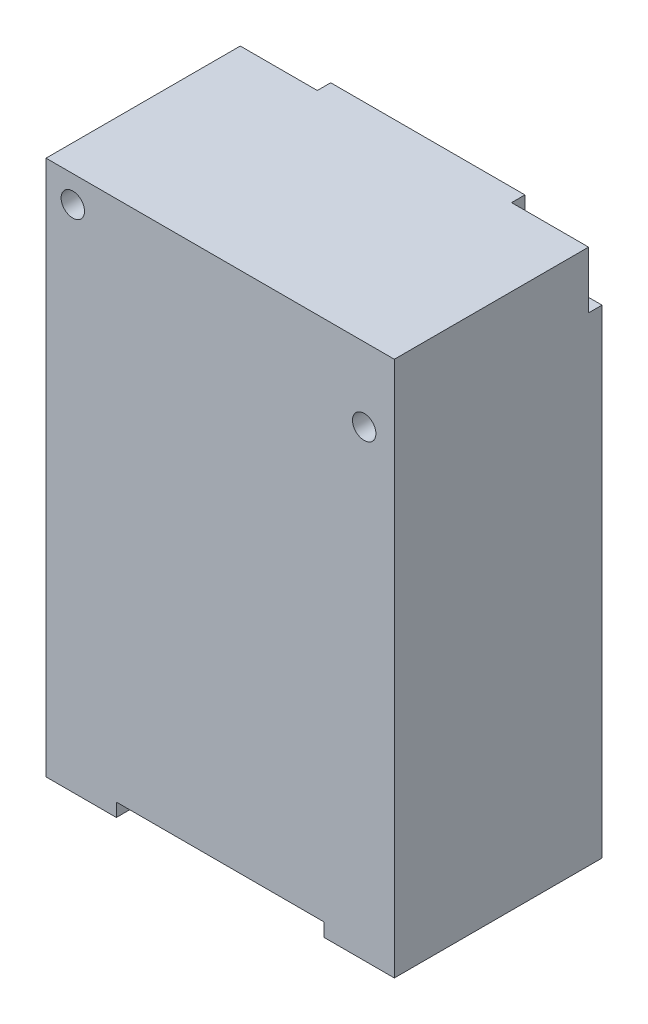
ISO-10303-21;
HEADER;
FILE_DESCRIPTION(('STEP AP214'),'2;1');
FILE_NAME('part.step','',(''),(''),'','','');
FILE_SCHEMA(('AUTOMOTIVE_DESIGN { 1 0 10303 214 1 1 1 1 }'));
ENDSEC;
DATA;
#1=APPLICATION_CONTEXT('core data for automotive mechanical design processes');
#2=APPLICATION_PROTOCOL_DEFINITION('international standard','automotive_design',2000,#1);
#3=PRODUCT_CONTEXT('',#1,'mechanical');
#4=PRODUCT('Part','Part','',(#3));
#5=PRODUCT_RELATED_PRODUCT_CATEGORY('part','',(#4));
#6=PRODUCT_DEFINITION_FORMATION('','',#4);
#7=PRODUCT_DEFINITION_CONTEXT('part definition',#1,'design');
#8=PRODUCT_DEFINITION('design','',#6,#7);
#9=PRODUCT_DEFINITION_SHAPE('','',#8);
#10=(LENGTH_UNIT() NAMED_UNIT(*) SI_UNIT(.MILLI.,.METRE.));
#11=(NAMED_UNIT(*) PLANE_ANGLE_UNIT() SI_UNIT($,.RADIAN.));
#12=(NAMED_UNIT(*) SI_UNIT($,.STERADIAN.) SOLID_ANGLE_UNIT());
#13=UNCERTAINTY_MEASURE_WITH_UNIT(LENGTH_MEASURE(1.E-05),#10,'distance_accuracy_value','');
#14=(GEOMETRIC_REPRESENTATION_CONTEXT(3) GLOBAL_UNCERTAINTY_ASSIGNED_CONTEXT((#13)) GLOBAL_UNIT_ASSIGNED_CONTEXT((#10,
#11,#12)) REPRESENTATION_CONTEXT('',''));
#15=CARTESIAN_POINT('',(0.,0.,0.));
#16=DIRECTION('',(0.,0.,1.));
#17=DIRECTION('',(1.,0.,0.));
#18=AXIS2_PLACEMENT_3D('',#15,#16,#17);
#19=CARTESIAN_POINT('',(0.,0.,31.));
#20=DIRECTION('',(0.,0.,1.));
#21=DIRECTION('',(1.,0.,0.));
#22=AXIS2_PLACEMENT_3D('',#19,#20,#21);
#23=PLANE('',#22);
#24=DIRECTION('',(0.,-1.,0.));
#25=VECTOR('',#24,1.);
#26=CARTESIAN_POINT('',(-15.5,-38.,31.));
#27=LINE('',#26,#25);
#28=CARTESIAN_POINT('',(-15.5,-38.,31.));
#29=VERTEX_POINT('',#28);
#30=CARTESIAN_POINT('',(-15.5,-40.,31.));
#31=VERTEX_POINT('',#30);
#32=EDGE_CURVE('E209',#29,#31,#27,.T.);
#33=ORIENTED_EDGE('',*,*,#32,.F.);
#34=DIRECTION('',(-1.,0.,0.));
#35=VECTOR('',#34,1.);
#36=CARTESIAN_POINT('',(15.5,-38.,31.));
#37=LINE('',#36,#35);
#38=CARTESIAN_POINT('',(15.5,-38.,31.));
#39=VERTEX_POINT('',#38);
#40=EDGE_CURVE('E199',#39,#29,#37,.T.);
#41=ORIENTED_EDGE('',*,*,#40,.F.);
#42=DIRECTION('',(0.,-1.,0.));
#43=VECTOR('',#42,1.);
#44=CARTESIAN_POINT('',(15.5,-38.,31.));
#45=LINE('',#44,#43);
#46=CARTESIAN_POINT('',(15.5,-40.,31.));
#47=VERTEX_POINT('',#46);
#48=EDGE_CURVE('E212',#39,#47,#45,.T.);
#49=ORIENTED_EDGE('',*,*,#48,.T.);
#50=DIRECTION('',(1.,0.,0.));
#51=VECTOR('',#50,1.);
#52=CARTESIAN_POINT('',(26.,-40.,31.));
#53=LINE('',#52,#51);
#54=CARTESIAN_POINT('',(26.,-40.,31.));
#55=VERTEX_POINT('',#54);
#56=EDGE_CURVE('E228',#47,#55,#53,.T.);
#57=ORIENTED_EDGE('',*,*,#56,.T.);
#58=DIRECTION('',(0.,1.,0.));
#59=VECTOR('',#58,1.);
#60=CARTESIAN_POINT('',(26.,-40.,31.));
#61=LINE('',#60,#59);
#62=CARTESIAN_POINT('',(26.,40.,31.));
#63=VERTEX_POINT('',#62);
#64=EDGE_CURVE('E233',#55,#63,#61,.T.);
#65=ORIENTED_EDGE('',*,*,#64,.T.);
#66=DIRECTION('',(-1.,0.,0.));
#67=VECTOR('',#66,1.);
#68=CARTESIAN_POINT('',(26.,40.,31.));
#69=LINE('',#68,#67);
#70=CARTESIAN_POINT('',(-26.,40.,31.));
#71=VERTEX_POINT('',#70);
#72=EDGE_CURVE('E235',#63,#71,#69,.T.);
#73=ORIENTED_EDGE('',*,*,#72,.T.);
#74=DIRECTION('',(0.,-1.,0.));
#75=VECTOR('',#74,1.);
#76=CARTESIAN_POINT('',(-26.,-40.,31.));
#77=LINE('',#76,#75);
#78=CARTESIAN_POINT('',(-26.,-40.,31.));
#79=VERTEX_POINT('',#78);
#80=EDGE_CURVE('E225',#71,#79,#77,.T.);
#81=ORIENTED_EDGE('',*,*,#80,.T.);
#82=EDGE_CURVE('E230',#79,#31,#53,.T.);
#83=ORIENTED_EDGE('',*,*,#82,.T.);
#84=EDGE_LOOP('',(#33,#41,#49,#57,#65,#73,#81,#83));
#85=FACE_BOUND('',#84,.T.);
#86=CARTESIAN_POINT('',(21.5,29.,31.));
#87=DIRECTION('',(0.,0.,1.));
#88=DIRECTION('',(1.,0.,0.));
#89=AXIS2_PLACEMENT_3D('',#86,#87,#88);
#90=CIRCLE('',#89,1.75);
#91=CARTESIAN_POINT('',(23.25,29.,31.));
#92=VERTEX_POINT('',#91);
#93=EDGE_CURVE('E221',#92,#92,#90,.T.);
#94=ORIENTED_EDGE('',*,*,#93,.F.);
#95=EDGE_LOOP('',(#94));
#96=FACE_BOUND('',#95,.T.);
#97=CARTESIAN_POINT('',(-22.,36.,31.));
#98=DIRECTION('',(0.,0.,1.));
#99=DIRECTION('',(1.,0.,0.));
#100=AXIS2_PLACEMENT_3D('',#97,#98,#99);
#101=CIRCLE('',#100,1.75);
#102=CARTESIAN_POINT('',(-20.25,36.,31.));
#103=VERTEX_POINT('',#102);
#104=EDGE_CURVE('E211',#103,#103,#101,.T.);
#105=ORIENTED_EDGE('',*,*,#104,.F.);
#106=EDGE_LOOP('',(#105));
#107=FACE_BOUND('',#106,.T.);
#108=ADVANCED_FACE('F36',(#85,#96,#107),#23,.T.);
#109=CARTESIAN_POINT('',(0.,0.,0.));
#110=DIRECTION('',(0.,0.,1.));
#111=DIRECTION('',(1.,0.,0.));
#112=AXIS2_PLACEMENT_3D('',#109,#110,#111);
#113=PLANE('',#112);
#114=DIRECTION('',(-1.,0.,0.));
#115=VECTOR('',#114,1.);
#116=CARTESIAN_POINT('',(26.,40.,0.));
#117=LINE('',#116,#115);
#118=CARTESIAN_POINT('',(14.5,40.,0.));
#119=VERTEX_POINT('',#118);
#120=CARTESIAN_POINT('',(-14.5,40.,0.));
#121=VERTEX_POINT('',#120);
#122=EDGE_CURVE('E229',#119,#121,#117,.T.);
#123=ORIENTED_EDGE('',*,*,#122,.F.);
#124=DIRECTION('',(0.,1.,0.));
#125=VECTOR('',#124,1.);
#126=CARTESIAN_POINT('',(14.5,40.,0.));
#127=LINE('',#126,#125);
#128=CARTESIAN_POINT('',(14.5,31.5,0.));
#129=VERTEX_POINT('',#128);
#130=EDGE_CURVE('E155',#129,#119,#127,.T.);
#131=ORIENTED_EDGE('',*,*,#130,.F.);
#132=DIRECTION('',(-1.,0.,0.));
#133=VECTOR('',#132,1.);
#134=CARTESIAN_POINT('',(26.,31.5,0.));
#135=LINE('',#134,#133);
#136=CARTESIAN_POINT('',(26.,31.5,0.));
#137=VERTEX_POINT('',#136);
#138=EDGE_CURVE('E181',#137,#129,#135,.T.);
#139=ORIENTED_EDGE('',*,*,#138,.F.);
#140=DIRECTION('',(0.,1.,0.));
#141=VECTOR('',#140,1.);
#142=CARTESIAN_POINT('',(26.,-40.,0.));
#143=LINE('',#142,#141);
#144=CARTESIAN_POINT('',(26.,-40.,0.));
#145=VERTEX_POINT('',#144);
#146=EDGE_CURVE('E161',#145,#137,#143,.T.);
#147=ORIENTED_EDGE('',*,*,#146,.F.);
#148=DIRECTION('',(1.,0.,0.));
#149=VECTOR('',#148,1.);
#150=CARTESIAN_POINT('',(26.,-40.,0.));
#151=LINE('',#150,#149);
#152=CARTESIAN_POINT('',(-26.,-40.,0.));
#153=VERTEX_POINT('',#152);
#154=EDGE_CURVE('E239',#153,#145,#151,.T.);
#155=ORIENTED_EDGE('',*,*,#154,.F.);
#156=DIRECTION('',(0.,-1.,0.));
#157=VECTOR('',#156,1.);
#158=CARTESIAN_POINT('',(-26.,-40.,0.));
#159=LINE('',#158,#157);
#160=CARTESIAN_POINT('',(-26.,31.5,0.));
#161=VERTEX_POINT('',#160);
#162=EDGE_CURVE('E224',#161,#153,#159,.T.);
#163=ORIENTED_EDGE('',*,*,#162,.F.);
#164=DIRECTION('',(-1.,0.,0.));
#165=VECTOR('',#164,1.);
#166=CARTESIAN_POINT('',(-26.,31.5,0.));
#167=LINE('',#166,#165);
#168=CARTESIAN_POINT('',(-14.5,31.5,0.));
#169=VERTEX_POINT('',#168);
#170=EDGE_CURVE('E175',#169,#161,#167,.T.);
#171=ORIENTED_EDGE('',*,*,#170,.F.);
#172=DIRECTION('',(0.,-1.,0.));
#173=VECTOR('',#172,1.);
#174=CARTESIAN_POINT('',(-14.5,40.,0.));
#175=LINE('',#174,#173);
#176=EDGE_CURVE('E177',#121,#169,#175,.T.);
#177=ORIENTED_EDGE('',*,*,#176,.F.);
#178=EDGE_LOOP('',(#123,#131,#139,#147,#155,#163,#171,#177));
#179=FACE_BOUND('',#178,.T.);
#180=ADVANCED_FACE('F267',(#179),#113,.F.);
#181=CARTESIAN_POINT('',(-26.,-40.,31.));
#182=DIRECTION('',(1.,0.,0.));
#183=DIRECTION('',(0.,1.,0.));
#184=AXIS2_PLACEMENT_3D('',#181,#182,#183);
#185=PLANE('',#184);
#186=DIRECTION('',(0.,1.,0.));
#187=VECTOR('',#186,1.);
#188=CARTESIAN_POINT('',(-26.,40.,2.));
#189=LINE('',#188,#187);
#190=CARTESIAN_POINT('',(-26.,31.5,2.));
#191=VERTEX_POINT('',#190);
#192=CARTESIAN_POINT('',(-26.,40.,2.));
#193=VERTEX_POINT('',#192);
#194=EDGE_CURVE('E59',#191,#193,#189,.T.);
#195=ORIENTED_EDGE('',*,*,#194,.F.);
#196=DIRECTION('',(0.,0.,-1.));
#197=VECTOR('',#196,1.);
#198=CARTESIAN_POINT('',(-26.,31.5,2.));
#199=LINE('',#198,#197);
#200=EDGE_CURVE('E172',#191,#161,#199,.T.);
#201=ORIENTED_EDGE('',*,*,#200,.T.);
#202=ORIENTED_EDGE('',*,*,#162,.T.);
#203=DIRECTION('',(0.,0.,-1.));
#204=VECTOR('',#203,1.);
#205=CARTESIAN_POINT('',(-26.,-40.,31.));
#206=LINE('',#205,#204);
#207=EDGE_CURVE('E250',#79,#153,#206,.T.);
#208=ORIENTED_EDGE('',*,*,#207,.F.);
#209=ORIENTED_EDGE('',*,*,#80,.F.);
#210=DIRECTION('',(0.,0.,-1.));
#211=VECTOR('',#210,1.);
#212=CARTESIAN_POINT('',(-26.,40.,31.));
#213=LINE('',#212,#211);
#214=EDGE_CURVE('E237',#71,#193,#213,.T.);
#215=ORIENTED_EDGE('',*,*,#214,.T.);
#216=EDGE_LOOP('',(#195,#201,#202,#208,#209,#215));
#217=FACE_BOUND('',#216,.T.);
#218=ADVANCED_FACE('F38',(#217),#185,.F.);
#219=CARTESIAN_POINT('',(26.,-40.,31.));
#220=DIRECTION('',(0.,1.,0.));
#221=DIRECTION('',(0.,0.,1.));
#222=AXIS2_PLACEMENT_3D('',#219,#220,#221);
#223=PLANE('',#222);
#224=DIRECTION('',(1.,0.,0.));
#225=VECTOR('',#224,1.);
#226=CARTESIAN_POINT('',(15.5,-40.,16.));
#227=LINE('',#226,#225);
#228=CARTESIAN_POINT('',(-15.5,-40.,16.));
#229=VERTEX_POINT('',#228);
#230=CARTESIAN_POINT('',(15.5,-40.,16.));
#231=VERTEX_POINT('',#230);
#232=EDGE_CURVE('E205',#229,#231,#227,.T.);
#233=ORIENTED_EDGE('',*,*,#232,.F.);
#234=DIRECTION('',(0.,0.,-1.));
#235=VECTOR('',#234,1.);
#236=CARTESIAN_POINT('',(-15.5,-40.,16.));
#237=LINE('',#236,#235);
#238=EDGE_CURVE('E203',#31,#229,#237,.T.);
#239=ORIENTED_EDGE('',*,*,#238,.F.);
#240=ORIENTED_EDGE('',*,*,#82,.F.);
#241=ORIENTED_EDGE('',*,*,#207,.T.);
#242=ORIENTED_EDGE('',*,*,#154,.T.);
#243=DIRECTION('',(0.,0.,-1.));
#244=VECTOR('',#243,1.);
#245=CARTESIAN_POINT('',(26.,-40.,31.));
#246=LINE('',#245,#244);
#247=EDGE_CURVE('E248',#55,#145,#246,.T.);
#248=ORIENTED_EDGE('',*,*,#247,.F.);
#249=ORIENTED_EDGE('',*,*,#56,.F.);
#250=DIRECTION('',(0.,0.,1.));
#251=VECTOR('',#250,1.);
#252=CARTESIAN_POINT('',(15.5,-40.,16.));
#253=LINE('',#252,#251);
#254=EDGE_CURVE('E193',#231,#47,#253,.T.);
#255=ORIENTED_EDGE('',*,*,#254,.F.);
#256=EDGE_LOOP('',(#233,#239,#240,#241,#242,#248,#249,#255));
#257=FACE_BOUND('',#256,.T.);
#258=ADVANCED_FACE('F292',(#257),#223,.F.);
#259=CARTESIAN_POINT('',(26.,-40.,31.));
#260=DIRECTION('',(-1.,0.,0.));
#261=DIRECTION('',(0.,0.,1.));
#262=AXIS2_PLACEMENT_3D('',#259,#260,#261);
#263=PLANE('',#262);
#264=ORIENTED_EDGE('',*,*,#146,.T.);
#265=DIRECTION('',(0.,0.,-1.));
#266=VECTOR('',#265,1.);
#267=CARTESIAN_POINT('',(26.,31.5,2.));
#268=LINE('',#267,#266);
#269=CARTESIAN_POINT('',(26.,31.5,2.));
#270=VERTEX_POINT('',#269);
#271=EDGE_CURVE('E143',#270,#137,#268,.T.);
#272=ORIENTED_EDGE('',*,*,#271,.F.);
#273=DIRECTION('',(0.,-1.,0.));
#274=VECTOR('',#273,1.);
#275=CARTESIAN_POINT('',(26.,40.,2.));
#276=LINE('',#275,#274);
#277=CARTESIAN_POINT('',(26.,40.,2.));
#278=VERTEX_POINT('',#277);
#279=EDGE_CURVE('E146',#278,#270,#276,.T.);
#280=ORIENTED_EDGE('',*,*,#279,.F.);
#281=DIRECTION('',(0.,0.,-1.));
#282=VECTOR('',#281,1.);
#283=CARTESIAN_POINT('',(26.,40.,31.));
#284=LINE('',#283,#282);
#285=EDGE_CURVE('E246',#63,#278,#284,.T.);
#286=ORIENTED_EDGE('',*,*,#285,.F.);
#287=ORIENTED_EDGE('',*,*,#64,.F.);
#288=ORIENTED_EDGE('',*,*,#247,.T.);
#289=EDGE_LOOP('',(#264,#272,#280,#286,#287,#288));
#290=FACE_BOUND('',#289,.T.);
#291=ADVANCED_FACE('F158',(#290),#263,.F.);
#292=CARTESIAN_POINT('',(26.,40.,31.));
#293=DIRECTION('',(0.,-1.,0.));
#294=DIRECTION('',(0.,0.,-1.));
#295=AXIS2_PLACEMENT_3D('',#292,#293,#294);
#296=PLANE('',#295);
#297=DIRECTION('',(1.,0.,0.));
#298=VECTOR('',#297,1.);
#299=CARTESIAN_POINT('',(26.,40.,2.));
#300=LINE('',#299,#298);
#301=CARTESIAN_POINT('',(14.5,40.,2.));
#302=VERTEX_POINT('',#301);
#303=EDGE_CURVE('E151',#302,#278,#300,.T.);
#304=ORIENTED_EDGE('',*,*,#303,.F.);
#305=DIRECTION('',(0.,0.,-1.));
#306=VECTOR('',#305,1.);
#307=CARTESIAN_POINT('',(14.5,40.,2.));
#308=LINE('',#307,#306);
#309=EDGE_CURVE('E163',#302,#119,#308,.T.);
#310=ORIENTED_EDGE('',*,*,#309,.T.);
#311=ORIENTED_EDGE('',*,*,#122,.T.);
#312=DIRECTION('',(0.,0.,-1.));
#313=VECTOR('',#312,1.);
#314=CARTESIAN_POINT('',(-14.5,40.,2.));
#315=LINE('',#314,#313);
#316=CARTESIAN_POINT('',(-14.5,40.,2.));
#317=VERTEX_POINT('',#316);
#318=EDGE_CURVE('E168',#317,#121,#315,.T.);
#319=ORIENTED_EDGE('',*,*,#318,.F.);
#320=DIRECTION('',(1.,0.,0.));
#321=VECTOR('',#320,1.);
#322=CARTESIAN_POINT('',(-26.,40.,2.));
#323=LINE('',#322,#321);
#324=EDGE_CURVE('E178',#193,#317,#323,.T.);
#325=ORIENTED_EDGE('',*,*,#324,.F.);
#326=ORIENTED_EDGE('',*,*,#214,.F.);
#327=ORIENTED_EDGE('',*,*,#72,.F.);
#328=ORIENTED_EDGE('',*,*,#285,.T.);
#329=EDGE_LOOP('',(#304,#310,#311,#319,#325,#326,#327,#328));
#330=FACE_BOUND('',#329,.T.);
#331=ADVANCED_FACE('F261',(#330),#296,.F.);
#332=CARTESIAN_POINT('',(21.5,29.,31.));
#333=DIRECTION('',(0.,0.,-1.));
#334=DIRECTION('',(-1.,0.,0.));
#335=AXIS2_PLACEMENT_3D('',#332,#333,#334);
#336=CYLINDRICAL_SURFACE('',#335,1.75);
#337=CARTESIAN_POINT('',(21.5,29.,25.));
#338=DIRECTION('',(0.,0.,1.));
#339=DIRECTION('',(1.,0.,0.));
#340=AXIS2_PLACEMENT_3D('',#337,#338,#339);
#341=CIRCLE('',#340,1.75);
#342=CARTESIAN_POINT('',(23.25,29.,25.));
#343=VERTEX_POINT('',#342);
#344=EDGE_CURVE('E44',#343,#343,#341,.T.);
#345=ORIENTED_EDGE('',*,*,#344,.F.);
#346=EDGE_LOOP('',(#345));
#347=FACE_BOUND('',#346,.T.);
#348=ORIENTED_EDGE('',*,*,#93,.T.);
#349=EDGE_LOOP('',(#348));
#350=FACE_BOUND('',#349,.T.);
#351=ADVANCED_FACE('F257',(#347,#350),#336,.F.);
#352=CARTESIAN_POINT('',(-22.,36.,31.));
#353=DIRECTION('',(0.,0.,-1.));
#354=DIRECTION('',(-1.,0.,0.));
#355=AXIS2_PLACEMENT_3D('',#352,#353,#354);
#356=CYLINDRICAL_SURFACE('',#355,1.75);
#357=CARTESIAN_POINT('',(-22.,36.,25.));
#358=DIRECTION('',(0.,0.,1.));
#359=DIRECTION('',(1.,0.,0.));
#360=AXIS2_PLACEMENT_3D('',#357,#358,#359);
#361=CIRCLE('',#360,1.75);
#362=CARTESIAN_POINT('',(-20.25,36.,25.));
#363=VERTEX_POINT('',#362);
#364=EDGE_CURVE('E11',#363,#363,#361,.T.);
#365=ORIENTED_EDGE('',*,*,#364,.F.);
#366=EDGE_LOOP('',(#365));
#367=FACE_BOUND('',#366,.T.);
#368=ORIENTED_EDGE('',*,*,#104,.T.);
#369=EDGE_LOOP('',(#368));
#370=FACE_BOUND('',#369,.T.);
#371=ADVANCED_FACE('F260',(#367,#370),#356,.F.);
#372=CARTESIAN_POINT('',(-15.5,-38.,16.));
#373=DIRECTION('',(-1.,0.,0.));
#374=DIRECTION('',(0.,0.,1.));
#375=AXIS2_PLACEMENT_3D('',#372,#373,#374);
#376=PLANE('',#375);
#377=ORIENTED_EDGE('',*,*,#238,.T.);
#378=DIRECTION('',(0.,-1.,0.));
#379=VECTOR('',#378,1.);
#380=CARTESIAN_POINT('',(-15.5,-38.,16.));
#381=LINE('',#380,#379);
#382=CARTESIAN_POINT('',(-15.5,-38.,16.));
#383=VERTEX_POINT('',#382);
#384=EDGE_CURVE('E202',#383,#229,#381,.T.);
#385=ORIENTED_EDGE('',*,*,#384,.F.);
#386=DIRECTION('',(0.,0.,-1.));
#387=VECTOR('',#386,1.);
#388=CARTESIAN_POINT('',(-15.5,-38.,16.));
#389=LINE('',#388,#387);
#390=EDGE_CURVE('E189',#29,#383,#389,.T.);
#391=ORIENTED_EDGE('',*,*,#390,.F.);
#392=ORIENTED_EDGE('',*,*,#32,.T.);
#393=EDGE_LOOP('',(#377,#385,#391,#392));
#394=FACE_BOUND('',#393,.T.);
#395=ADVANCED_FACE('F273',(#394),#376,.F.);
#396=CARTESIAN_POINT('',(15.5,-38.,16.));
#397=DIRECTION('',(1.,0.,0.));
#398=DIRECTION('',(0.,0.,-1.));
#399=AXIS2_PLACEMENT_3D('',#396,#397,#398);
#400=PLANE('',#399);
#401=ORIENTED_EDGE('',*,*,#254,.T.);
#402=ORIENTED_EDGE('',*,*,#48,.F.);
#403=DIRECTION('',(0.,0.,1.));
#404=VECTOR('',#403,1.);
#405=CARTESIAN_POINT('',(15.5,-38.,16.));
#406=LINE('',#405,#404);
#407=CARTESIAN_POINT('',(15.5,-38.,16.));
#408=VERTEX_POINT('',#407);
#409=EDGE_CURVE('E196',#408,#39,#406,.T.);
#410=ORIENTED_EDGE('',*,*,#409,.F.);
#411=DIRECTION('',(0.,-1.,0.));
#412=VECTOR('',#411,1.);
#413=CARTESIAN_POINT('',(15.5,-38.,16.));
#414=LINE('',#413,#412);
#415=EDGE_CURVE('E215',#408,#231,#414,.T.);
#416=ORIENTED_EDGE('',*,*,#415,.T.);
#417=EDGE_LOOP('',(#401,#402,#410,#416));
#418=FACE_BOUND('',#417,.T.);
#419=ADVANCED_FACE('F279',(#418),#400,.F.);
#420=CARTESIAN_POINT('',(15.5,-38.,16.));
#421=DIRECTION('',(0.,0.,-1.));
#422=DIRECTION('',(-1.,0.,0.));
#423=AXIS2_PLACEMENT_3D('',#420,#421,#422);
#424=PLANE('',#423);
#425=ORIENTED_EDGE('',*,*,#232,.T.);
#426=ORIENTED_EDGE('',*,*,#415,.F.);
#427=DIRECTION('',(1.,0.,0.));
#428=VECTOR('',#427,1.);
#429=CARTESIAN_POINT('',(15.5,-38.,16.));
#430=LINE('',#429,#428);
#431=EDGE_CURVE('E192',#383,#408,#430,.T.);
#432=ORIENTED_EDGE('',*,*,#431,.F.);
#433=ORIENTED_EDGE('',*,*,#384,.T.);
#434=EDGE_LOOP('',(#425,#426,#432,#433));
#435=FACE_BOUND('',#434,.T.);
#436=ADVANCED_FACE('F304',(#435),#424,.F.);
#437=CARTESIAN_POINT('',(0.,-38.,0.));
#438=DIRECTION('',(0.,-1.,0.));
#439=DIRECTION('',(0.,0.,-1.));
#440=AXIS2_PLACEMENT_3D('',#437,#438,#439);
#441=PLANE('',#440);
#442=ORIENTED_EDGE('',*,*,#390,.T.);
#443=ORIENTED_EDGE('',*,*,#431,.T.);
#444=ORIENTED_EDGE('',*,*,#409,.T.);
#445=ORIENTED_EDGE('',*,*,#40,.T.);
#446=EDGE_LOOP('',(#442,#443,#444,#445));
#447=FACE_BOUND('',#446,.T.);
#448=ADVANCED_FACE('F349',(#447),#441,.T.);
#449=CARTESIAN_POINT('',(0.,0.,25.));
#450=DIRECTION('',(0.,0.,1.));
#451=DIRECTION('',(1.,0.,0.));
#452=AXIS2_PLACEMENT_3D('',#449,#450,#451);
#453=PLANE('',#452);
#454=ORIENTED_EDGE('',*,*,#344,.T.);
#455=EDGE_LOOP('',(#454));
#456=FACE_BOUND('',#455,.T.);
#457=ADVANCED_FACE('F255',(#456),#453,.T.);
#458=CARTESIAN_POINT('',(-22.,36.,25.));
#459=DIRECTION('',(0.,0.,1.));
#460=DIRECTION('',(1.,0.,0.));
#461=AXIS2_PLACEMENT_3D('',#458,#459,#460);
#462=PLANE('',#461);
#463=ORIENTED_EDGE('',*,*,#364,.T.);
#464=EDGE_LOOP('',(#463));
#465=FACE_BOUND('',#464,.T.);
#466=ADVANCED_FACE('F333',(#465),#462,.T.);
#467=CARTESIAN_POINT('',(-26.,31.5,2.));
#468=DIRECTION('',(0.,-1.,0.));
#469=DIRECTION('',(0.,0.,-1.));
#470=AXIS2_PLACEMENT_3D('',#467,#468,#469);
#471=PLANE('',#470);
#472=ORIENTED_EDGE('',*,*,#170,.T.);
#473=ORIENTED_EDGE('',*,*,#200,.F.);
#474=DIRECTION('',(-1.,0.,0.));
#475=VECTOR('',#474,1.);
#476=CARTESIAN_POINT('',(-26.,31.5,2.));
#477=LINE('',#476,#475);
#478=CARTESIAN_POINT('',(-14.5,31.5,2.));
#479=VERTEX_POINT('',#478);
#480=EDGE_CURVE('E183',#479,#191,#477,.T.);
#481=ORIENTED_EDGE('',*,*,#480,.F.);
#482=DIRECTION('',(0.,0.,-1.));
#483=VECTOR('',#482,1.);
#484=CARTESIAN_POINT('',(-14.5,31.5,2.));
#485=LINE('',#484,#483);
#486=EDGE_CURVE('E170',#479,#169,#485,.T.);
#487=ORIENTED_EDGE('',*,*,#486,.T.);
#488=EDGE_LOOP('',(#472,#473,#481,#487));
#489=FACE_BOUND('',#488,.T.);
#490=ADVANCED_FACE('F331',(#489),#471,.F.);
#491=CARTESIAN_POINT('',(-14.5,40.,2.));
#492=DIRECTION('',(1.,0.,0.));
#493=DIRECTION('',(0.,1.,0.));
#494=AXIS2_PLACEMENT_3D('',#491,#492,#493);
#495=PLANE('',#494);
#496=ORIENTED_EDGE('',*,*,#176,.T.);
#497=ORIENTED_EDGE('',*,*,#486,.F.);
#498=DIRECTION('',(0.,-1.,0.));
#499=VECTOR('',#498,1.);
#500=CARTESIAN_POINT('',(-14.5,40.,2.));
#501=LINE('',#500,#499);
#502=EDGE_CURVE('E185',#317,#479,#501,.T.);
#503=ORIENTED_EDGE('',*,*,#502,.F.);
#504=ORIENTED_EDGE('',*,*,#318,.T.);
#505=EDGE_LOOP('',(#496,#497,#503,#504));
#506=FACE_BOUND('',#505,.T.);
#507=ADVANCED_FACE('F325',(#506),#495,.F.);
#508=CARTESIAN_POINT('',(0.,0.,2.));
#509=DIRECTION('',(0.,0.,-1.));
#510=DIRECTION('',(-1.,0.,0.));
#511=AXIS2_PLACEMENT_3D('',#508,#509,#510);
#512=PLANE('',#511);
#513=ORIENTED_EDGE('',*,*,#324,.T.);
#514=ORIENTED_EDGE('',*,*,#502,.T.);
#515=ORIENTED_EDGE('',*,*,#480,.T.);
#516=ORIENTED_EDGE('',*,*,#194,.T.);
#517=EDGE_LOOP('',(#513,#514,#515,#516));
#518=FACE_BOUND('',#517,.T.);
#519=ADVANCED_FACE('F329',(#518),#512,.T.);
#520=CARTESIAN_POINT('',(14.5,40.,2.));
#521=DIRECTION('',(-1.,0.,0.));
#522=DIRECTION('',(0.,0.,1.));
#523=AXIS2_PLACEMENT_3D('',#520,#521,#522);
#524=PLANE('',#523);
#525=ORIENTED_EDGE('',*,*,#130,.T.);
#526=ORIENTED_EDGE('',*,*,#309,.F.);
#527=DIRECTION('',(0.,1.,0.));
#528=VECTOR('',#527,1.);
#529=CARTESIAN_POINT('',(14.5,40.,2.));
#530=LINE('',#529,#528);
#531=CARTESIAN_POINT('',(14.5,31.5,2.));
#532=VERTEX_POINT('',#531);
#533=EDGE_CURVE('E51',#532,#302,#530,.T.);
#534=ORIENTED_EDGE('',*,*,#533,.F.);
#535=DIRECTION('',(0.,0.,-1.));
#536=VECTOR('',#535,1.);
#537=CARTESIAN_POINT('',(14.5,31.5,2.));
#538=LINE('',#537,#536);
#539=EDGE_CURVE('E145',#532,#129,#538,.T.);
#540=ORIENTED_EDGE('',*,*,#539,.T.);
#541=EDGE_LOOP('',(#525,#526,#534,#540));
#542=FACE_BOUND('',#541,.T.);
#543=ADVANCED_FACE('F345',(#542),#524,.F.);
#544=CARTESIAN_POINT('',(26.,31.5,2.));
#545=DIRECTION('',(0.,-1.,0.));
#546=DIRECTION('',(0.,0.,-1.));
#547=AXIS2_PLACEMENT_3D('',#544,#545,#546);
#548=PLANE('',#547);
#549=ORIENTED_EDGE('',*,*,#138,.T.);
#550=ORIENTED_EDGE('',*,*,#539,.F.);
#551=DIRECTION('',(-1.,0.,0.));
#552=VECTOR('',#551,1.);
#553=CARTESIAN_POINT('',(26.,31.5,2.));
#554=LINE('',#553,#552);
#555=EDGE_CURVE('E138',#270,#532,#554,.T.);
#556=ORIENTED_EDGE('',*,*,#555,.F.);
#557=ORIENTED_EDGE('',*,*,#271,.T.);
#558=EDGE_LOOP('',(#549,#550,#556,#557));
#559=FACE_BOUND('',#558,.T.);
#560=ADVANCED_FACE('F141',(#559),#548,.F.);
#561=CARTESIAN_POINT('',(0.,0.,2.));
#562=DIRECTION('',(0.,0.,-1.));
#563=DIRECTION('',(-1.,0.,0.));
#564=AXIS2_PLACEMENT_3D('',#561,#562,#563);
#565=PLANE('',#564);
#566=ORIENTED_EDGE('',*,*,#279,.T.);
#567=ORIENTED_EDGE('',*,*,#555,.T.);
#568=ORIENTED_EDGE('',*,*,#533,.T.);
#569=ORIENTED_EDGE('',*,*,#303,.T.);
#570=EDGE_LOOP('',(#566,#567,#568,#569));
#571=FACE_BOUND('',#570,.T.);
#572=ADVANCED_FACE('F149',(#571),#565,.T.);
#573=CLOSED_SHELL('',(#108,#180,#218,#258,#291,#331,#351,#371,#395,#419,#436,#448,#457,#466,
#490,#507,#519,#543,#560,#572));
#574=MANIFOLD_SOLID_BREP('B2',#573);
#575=ADVANCED_BREP_SHAPE_REPRESENTATION('',(#18,#574),#14);
#576=SHAPE_DEFINITION_REPRESENTATION(#9,#575);
ENDSEC;
END-ISO-10303-21;
